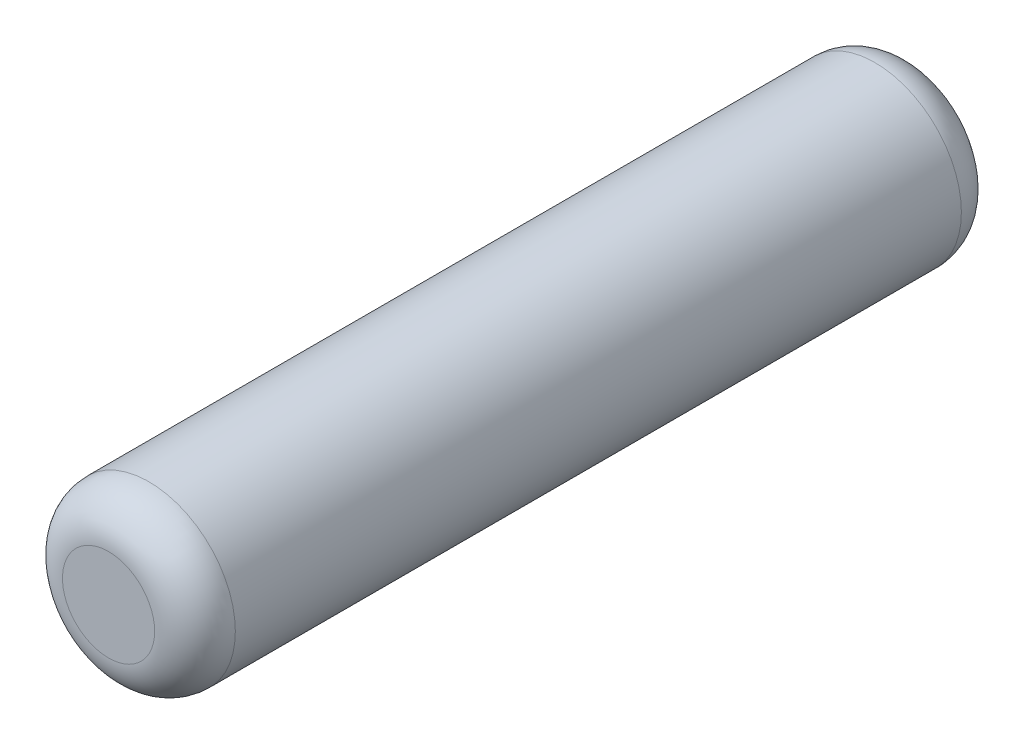
ISO-10303-21;
HEADER;
FILE_DESCRIPTION(('STEP AP214'),'2;1');
FILE_NAME('part.step','',(''),(''),'','','');
FILE_SCHEMA(('AUTOMOTIVE_DESIGN { 1 0 10303 214 1 1 1 1 }'));
ENDSEC;
DATA;
#1=APPLICATION_CONTEXT('core data for automotive mechanical design processes');
#2=APPLICATION_PROTOCOL_DEFINITION('international standard','automotive_design',2000,#1);
#3=PRODUCT_CONTEXT('',#1,'mechanical');
#4=PRODUCT('Part','Part','',(#3));
#5=PRODUCT_RELATED_PRODUCT_CATEGORY('part','',(#4));
#6=PRODUCT_DEFINITION_FORMATION('','',#4);
#7=PRODUCT_DEFINITION_CONTEXT('part definition',#1,'design');
#8=PRODUCT_DEFINITION('design','',#6,#7);
#9=PRODUCT_DEFINITION_SHAPE('','',#8);
#10=(LENGTH_UNIT() NAMED_UNIT(*) SI_UNIT(.MILLI.,.METRE.));
#11=(NAMED_UNIT(*) PLANE_ANGLE_UNIT() SI_UNIT($,.RADIAN.));
#12=(NAMED_UNIT(*) SI_UNIT($,.STERADIAN.) SOLID_ANGLE_UNIT());
#13=UNCERTAINTY_MEASURE_WITH_UNIT(LENGTH_MEASURE(1.E-05),#10,'distance_accuracy_value','');
#14=(GEOMETRIC_REPRESENTATION_CONTEXT(3) GLOBAL_UNCERTAINTY_ASSIGNED_CONTEXT((#13)) GLOBAL_UNIT_ASSIGNED_CONTEXT((#10,
#11,#12)) REPRESENTATION_CONTEXT('',''));
#15=CARTESIAN_POINT('',(0.,0.,0.));
#16=DIRECTION('',(0.,0.,1.));
#17=DIRECTION('',(1.,0.,0.));
#18=AXIS2_PLACEMENT_3D('',#15,#16,#17);
#19=CARTESIAN_POINT('',(0.,0.,3.5));
#20=DIRECTION('',(0.,0.,-1.));
#21=DIRECTION('',(-1.,0.,0.));
#22=AXIS2_PLACEMENT_3D('',#19,#20,#21);
#23=CYLINDRICAL_SURFACE('',#22,0.75);
#24=CARTESIAN_POINT('',(0.,0.,-3.15));
#25=DIRECTION('',(0.,0.,1.));
#26=DIRECTION('',(1.,0.,0.));
#27=AXIS2_PLACEMENT_3D('',#24,#25,#26);
#28=CIRCLE('',#27,0.75);
#29=CARTESIAN_POINT('',(0.75,0.,-3.15));
#30=VERTEX_POINT('',#29);
#31=EDGE_CURVE('E42',#30,#30,#28,.T.);
#32=ORIENTED_EDGE('',*,*,#31,.T.);
#33=EDGE_LOOP('',(#32));
#34=FACE_BOUND('',#33,.T.);
#35=CARTESIAN_POINT('',(0.,0.,3.15));
#36=DIRECTION('',(0.,0.,1.));
#37=DIRECTION('',(1.,0.,0.));
#38=AXIS2_PLACEMENT_3D('',#35,#36,#37);
#39=CIRCLE('',#38,0.75);
#40=CARTESIAN_POINT('',(0.75,0.,3.15));
#41=VERTEX_POINT('',#40);
#42=EDGE_CURVE('E46',#41,#41,#39,.F.);
#43=ORIENTED_EDGE('',*,*,#42,.T.);
#44=EDGE_LOOP('',(#43));
#45=FACE_BOUND('',#44,.T.);
#46=ADVANCED_FACE('F31',(#34,#45),#23,.T.);
#47=CARTESIAN_POINT('',(0.,0.,3.5));
#48=DIRECTION('',(0.,0.,1.));
#49=DIRECTION('',(1.,0.,0.));
#50=AXIS2_PLACEMENT_3D('',#47,#48,#49);
#51=PLANE('',#50);
#52=CARTESIAN_POINT('',(0.,0.,3.5));
#53=DIRECTION('',(0.,0.,1.));
#54=DIRECTION('',(1.,0.,0.));
#55=AXIS2_PLACEMENT_3D('',#52,#53,#54);
#56=CIRCLE('',#55,0.4);
#57=CARTESIAN_POINT('',(0.4,0.,3.5));
#58=VERTEX_POINT('',#57);
#59=EDGE_CURVE('E10',#58,#58,#56,.T.);
#60=ORIENTED_EDGE('',*,*,#59,.T.);
#61=EDGE_LOOP('',(#60));
#62=FACE_BOUND('',#61,.T.);
#63=ADVANCED_FACE('F62',(#62),#51,.T.);
#64=CARTESIAN_POINT('',(0.,0.,-3.5));
#65=DIRECTION('',(0.,0.,1.));
#66=DIRECTION('',(1.,0.,0.));
#67=AXIS2_PLACEMENT_3D('',#64,#65,#66);
#68=PLANE('',#67);
#69=CARTESIAN_POINT('',(0.,0.,-3.5));
#70=DIRECTION('',(0.,0.,1.));
#71=DIRECTION('',(1.,0.,0.));
#72=AXIS2_PLACEMENT_3D('',#69,#70,#71);
#73=CIRCLE('',#72,0.4);
#74=CARTESIAN_POINT('',(0.4,0.,-3.5));
#75=VERTEX_POINT('',#74);
#76=EDGE_CURVE('E38',#75,#75,#73,.F.);
#77=ORIENTED_EDGE('',*,*,#76,.T.);
#78=EDGE_LOOP('',(#77));
#79=FACE_BOUND('',#78,.T.);
#80=ADVANCED_FACE('F59',(#79),#68,.F.);
#81=CARTESIAN_POINT('',(0.,0.,-3.15));
#82=DIRECTION('',(0.,0.,1.));
#83=DIRECTION('',(1.,0.,0.));
#84=AXIS2_PLACEMENT_3D('',#81,#82,#83);
#85=TOROIDAL_SURFACE('',#84,0.4,0.35);
#86=ORIENTED_EDGE('',*,*,#76,.F.);
#87=EDGE_LOOP('',(#86));
#88=FACE_BOUND('',#87,.T.);
#89=ORIENTED_EDGE('',*,*,#31,.F.);
#90=EDGE_LOOP('',(#89));
#91=FACE_BOUND('',#90,.T.);
#92=ADVANCED_FACE('F55',(#88,#91),#85,.T.);
#93=CARTESIAN_POINT('',(0.,0.,3.15));
#94=DIRECTION('',(0.,0.,1.));
#95=DIRECTION('',(1.,0.,0.));
#96=AXIS2_PLACEMENT_3D('',#93,#94,#95);
#97=TOROIDAL_SURFACE('',#96,0.4,0.35);
#98=ORIENTED_EDGE('',*,*,#42,.F.);
#99=EDGE_LOOP('',(#98));
#100=FACE_BOUND('',#99,.T.);
#101=ORIENTED_EDGE('',*,*,#59,.F.);
#102=EDGE_LOOP('',(#101));
#103=FACE_BOUND('',#102,.T.);
#104=ADVANCED_FACE('F33',(#100,#103),#97,.T.);
#105=CLOSED_SHELL('',(#46,#63,#80,#92,#104));
#106=MANIFOLD_SOLID_BREP('B2',#105);
#107=ADVANCED_BREP_SHAPE_REPRESENTATION('',(#18,#106),#14);
#108=SHAPE_DEFINITION_REPRESENTATION(#9,#107);
ENDSEC;
END-ISO-10303-21;
